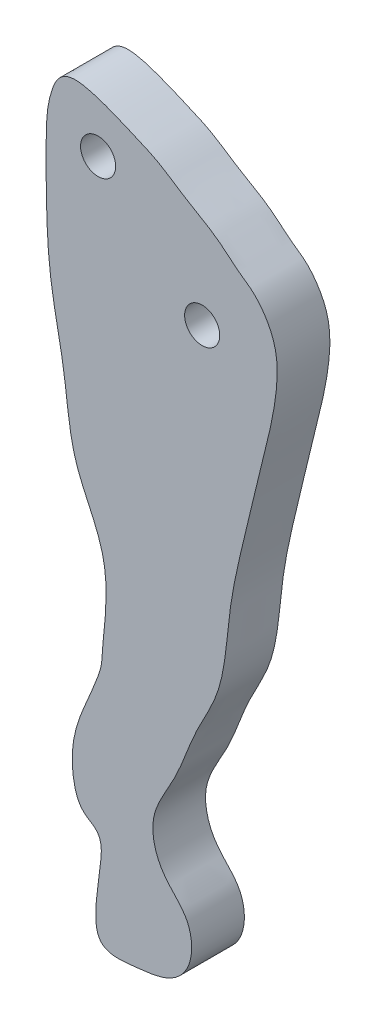
ISO-10303-21;
HEADER;
FILE_DESCRIPTION(('STEP AP214'),'2;1');
FILE_NAME('part.step','',(''),(''),'','','');
FILE_SCHEMA(('AUTOMOTIVE_DESIGN { 1 0 10303 214 1 1 1 1 }'));
ENDSEC;
DATA;
#1=APPLICATION_CONTEXT('core data for automotive mechanical design processes');
#2=APPLICATION_PROTOCOL_DEFINITION('international standard','automotive_design',2000,#1);
#3=PRODUCT_CONTEXT('',#1,'mechanical');
#4=PRODUCT('Part','Part','',(#3));
#5=PRODUCT_RELATED_PRODUCT_CATEGORY('part','',(#4));
#6=PRODUCT_DEFINITION_FORMATION('','',#4);
#7=PRODUCT_DEFINITION_CONTEXT('part definition',#1,'design');
#8=PRODUCT_DEFINITION('design','',#6,#7);
#9=PRODUCT_DEFINITION_SHAPE('','',#8);
#10=(LENGTH_UNIT() NAMED_UNIT(*) SI_UNIT(.MILLI.,.METRE.));
#11=(NAMED_UNIT(*) PLANE_ANGLE_UNIT() SI_UNIT($,.RADIAN.));
#12=(NAMED_UNIT(*) SI_UNIT($,.STERADIAN.) SOLID_ANGLE_UNIT());
#13=UNCERTAINTY_MEASURE_WITH_UNIT(LENGTH_MEASURE(1.E-05),#10,'distance_accuracy_value','');
#14=(GEOMETRIC_REPRESENTATION_CONTEXT(3) GLOBAL_UNCERTAINTY_ASSIGNED_CONTEXT((#13)) GLOBAL_UNIT_ASSIGNED_CONTEXT((#10,
#11,#12)) REPRESENTATION_CONTEXT('',''));
#15=CARTESIAN_POINT('',(0.,0.,0.));
#16=DIRECTION('',(0.,0.,1.));
#17=DIRECTION('',(1.,0.,0.));
#18=AXIS2_PLACEMENT_3D('',#15,#16,#17);
#19=CARTESIAN_POINT('',(-7.75068640306047,-27.7299169254581,3.));
#20=DIRECTION('',(0.,0.,1.));
#21=DIRECTION('',(1.,0.,0.));
#22=AXIS2_PLACEMENT_3D('',#19,#20,#21);
#23=PLANE('',#22);
#24=CARTESIAN_POINT('',(-12.874737023213,9.66234321452957,3.));
#25=DIRECTION('',(0.,0.,1.));
#26=DIRECTION('',(1.,0.,0.));
#27=AXIS2_PLACEMENT_3D('',#24,#25,#26);
#28=CIRCLE('',#27,1.);
#29=CARTESIAN_POINT('',(-11.874737023213,9.66234321452957,3.));
#30=VERTEX_POINT('',#29);
#31=EDGE_CURVE('E46',#30,#30,#28,.T.);
#32=ORIENTED_EDGE('',*,*,#31,.F.);
#33=EDGE_LOOP('',(#32));
#34=FACE_BOUND('',#33,.T.);
#35=CARTESIAN_POINT('',(-15.4682044561492,11.7127470551141,3.));
#36=CARTESIAN_POINT('',(-15.7544673100658,10.9171451790748,3.));
#37=CARTESIAN_POINT('',(-15.8441456091741,9.52640485430083,3.));
#38=CARTESIAN_POINT('',(-15.8377536950557,5.99024798509293,3.));
#39=CARTESIAN_POINT('',(-15.7086350765638,2.21922776594689,3.));
#40=CARTESIAN_POINT('',(-14.6830809593332,-1.98597907958292,3.));
#41=CARTESIAN_POINT('',(-14.4535239210102,-6.34819043758016,3.));
#42=CARTESIAN_POINT('',(-12.0344761797973,-9.80140381526344,3.));
#43=CARTESIAN_POINT('',(-12.8445754757671,-15.7320977367462,3.));
#44=CARTESIAN_POINT('',(-12.4673436919587,-15.1428809154969,3.));
#45=CARTESIAN_POINT('',(-14.5672957333291,-19.967840925612,3.));
#46=CARTESIAN_POINT('',(-14.1266697429101,-22.990564433252,3.));
#47=CARTESIAN_POINT('',(-12.4487210163301,-23.6774489776159,3.));
#48=CARTESIAN_POINT('',(-12.7469655455262,-24.9861346245134,3.));
#49=CARTESIAN_POINT('',(-13.2740593441268,-29.5417563099526,3.));
#50=CARTESIAN_POINT('',(-11.0194235705127,-29.275771778189,3.));
#51=CARTESIAN_POINT('',(-8.6938773371134,-29.0443670100423,3.));
#52=CARTESIAN_POINT('',(-7.42130025178239,-27.7007159992083,3.));
#53=CARTESIAN_POINT('',(-7.56803412746985,-25.2776182334678,3.));
#54=CARTESIAN_POINT('',(-9.40773930226199,-23.9484320171084,3.));
#55=CARTESIAN_POINT('',(-10.0991753781121,-21.2773045525642,3.));
#56=CARTESIAN_POINT('',(-8.34889322816995,-18.8594392819673,3.));
#57=CARTESIAN_POINT('',(-7.50780860088234,-16.0940305767003,3.));
#58=CARTESIAN_POINT('',(-5.63135078781031,-13.0445297644753,3.));
#59=CARTESIAN_POINT('',(-5.52782898057051,-8.84776405611098,3.));
#60=CARTESIAN_POINT('',(-4.47074765830761,-4.72991582790627,3.));
#61=CARTESIAN_POINT('',(-3.69943878110338,-1.34684714443823,3.));
#62=CARTESIAN_POINT('',(-3.10205964326893,0.907695055283288,3.));
#63=CARTESIAN_POINT('',(-2.62986421475999,3.30204689048553,3.));
#64=CARTESIAN_POINT('',(-2.65088275301096,5.6577304133364,3.));
#65=CARTESIAN_POINT('',(-3.81964933684487,7.26492470645652,3.));
#66=CARTESIAN_POINT('',(-4.4681191262396,7.6881431822958,3.));
#67=CARTESIAN_POINT('',(-5.22414609410086,8.24055464810256,3.));
#68=CARTESIAN_POINT('',(-6.08616979972861,9.07665167758778,3.));
#69=CARTESIAN_POINT('',(-7.93560640497182,10.0666801998551,3.));
#70=CARTESIAN_POINT('',(-9.37885999057812,11.1011055768679,3.));
#71=CARTESIAN_POINT('',(-10.7472108757102,11.6856200716329,3.));
#72=CARTESIAN_POINT('',(-14.6942617711478,13.3754564952877,3.));
#73=CARTESIAN_POINT('',(-15.2724463231781,12.2568118393181,3.));
#74=CARTESIAN_POINT('',(-15.4682044561492,11.7127470551141,3.));
#75=B_SPLINE_CURVE_WITH_KNOTS('',3,(#35,#36,#37,#38,#39,#40,#41,#42,#43,#44,#45,#46,#47,#48,#49,
#50,#51,#52,#53,#54,#55,#56,#57,#58,#59,#60,#61,#62,#63,#64,#65,#66,#67,#68,#69,#70,#71,#72,#73,
#74),.UNSPECIFIED.,.T.,.F.,(4,1,1,1,1,1,1,1,1,1,1,1,1,1,1,1,1,1,1,1,1,1,1,1,1,1,1,1,1,1,1,1,1,1,
1,1,1,4),(0.,0.0280294497832513,0.0573151668265758,0.107085229722712,0.15053059861478,
0.195480441114869,0.242856263773221,0.284868296441459,0.346028631029938,0.365258833711303,
0.377334448121911,0.390295357574165,0.42466315868929,0.443525871396655,0.464371613909533,
0.479434702604769,0.503023913874125,0.523701089664602,0.547079179766223,0.572270659609402,
0.602358089488805,0.637256406214172,0.665265584942903,0.714860943360043,0.767135942011383,
0.803257978311219,0.822217077505681,0.849264836467304,0.874571821179535,0.898521318281409,
0.903179517514216,0.905265809712138,0.919384240260622,0.934637401372006,0.950778869954402,
0.964147985663621,0.980832327063381,1.),.UNSPECIFIED.);
#76=CARTESIAN_POINT('',(-15.4682044561492,11.7127470551141,3.));
#77=VERTEX_POINT('',#76);
#78=EDGE_CURVE('E10',#77,#77,#75,.T.);
#79=ORIENTED_EDGE('',*,*,#78,.T.);
#80=EDGE_LOOP('',(#79));
#81=FACE_BOUND('',#80,.T.);
#82=CARTESIAN_POINT('',(-6.94707134946173,4.28993410313171,3.));
#83=DIRECTION('',(0.,0.,1.));
#84=DIRECTION('',(1.,0.,0.));
#85=AXIS2_PLACEMENT_3D('',#82,#83,#84);
#86=CIRCLE('',#85,1.);
#87=CARTESIAN_POINT('',(-5.94707134946173,4.28993410313171,3.));
#88=VERTEX_POINT('',#87);
#89=EDGE_CURVE('E57',#88,#88,#86,.T.);
#90=ORIENTED_EDGE('',*,*,#89,.F.);
#91=EDGE_LOOP('',(#90));
#92=FACE_BOUND('',#91,.T.);
#93=ADVANCED_FACE('F33',(#34,#81,#92),#23,.T.);
#94=CARTESIAN_POINT('',(-7.75068640306047,-27.7299169254581,0.));
#95=DIRECTION('',(0.,0.,1.));
#96=DIRECTION('',(1.,0.,0.));
#97=AXIS2_PLACEMENT_3D('',#94,#95,#96);
#98=PLANE('',#97);
#99=CARTESIAN_POINT('',(-15.4682044561492,11.7127470551141,0.));
#100=CARTESIAN_POINT('',(-15.7544673100658,10.9171451790748,0.));
#101=CARTESIAN_POINT('',(-15.8441456091741,9.52640485430083,0.));
#102=CARTESIAN_POINT('',(-15.8377536950557,5.99024798509293,0.));
#103=CARTESIAN_POINT('',(-15.7086350765638,2.21922776594689,0.));
#104=CARTESIAN_POINT('',(-14.6830809593332,-1.98597907958292,0.));
#105=CARTESIAN_POINT('',(-14.4535239210102,-6.34819043758016,0.));
#106=CARTESIAN_POINT('',(-12.0344761797973,-9.80140381526344,0.));
#107=CARTESIAN_POINT('',(-12.8445754757671,-15.7320977367462,0.));
#108=CARTESIAN_POINT('',(-12.4673436919587,-15.1428809154969,0.));
#109=CARTESIAN_POINT('',(-14.5672957333291,-19.967840925612,0.));
#110=CARTESIAN_POINT('',(-14.1266697429101,-22.990564433252,0.));
#111=CARTESIAN_POINT('',(-12.4487210163301,-23.6774489776159,0.));
#112=CARTESIAN_POINT('',(-12.7469655455262,-24.9861346245134,0.));
#113=CARTESIAN_POINT('',(-13.2740593441268,-29.5417563099526,0.));
#114=CARTESIAN_POINT('',(-11.0194235705127,-29.275771778189,0.));
#115=CARTESIAN_POINT('',(-8.6938773371134,-29.0443670100423,0.));
#116=CARTESIAN_POINT('',(-7.42130025178239,-27.7007159992083,0.));
#117=CARTESIAN_POINT('',(-7.56803412746985,-25.2776182334678,0.));
#118=CARTESIAN_POINT('',(-9.40773930226199,-23.9484320171084,0.));
#119=CARTESIAN_POINT('',(-10.0991753781121,-21.2773045525642,0.));
#120=CARTESIAN_POINT('',(-8.34889322816995,-18.8594392819673,0.));
#121=CARTESIAN_POINT('',(-7.50780860088234,-16.0940305767003,0.));
#122=CARTESIAN_POINT('',(-5.63135078781031,-13.0445297644753,0.));
#123=CARTESIAN_POINT('',(-5.52782898057051,-8.84776405611098,0.));
#124=CARTESIAN_POINT('',(-4.47074765830761,-4.72991582790627,0.));
#125=CARTESIAN_POINT('',(-3.69943878110338,-1.34684714443823,0.));
#126=CARTESIAN_POINT('',(-3.10205964326893,0.907695055283288,0.));
#127=CARTESIAN_POINT('',(-2.62986421475999,3.30204689048553,0.));
#128=CARTESIAN_POINT('',(-2.65088275301096,5.6577304133364,0.));
#129=CARTESIAN_POINT('',(-3.81964933684487,7.26492470645652,0.));
#130=CARTESIAN_POINT('',(-4.4681191262396,7.6881431822958,0.));
#131=CARTESIAN_POINT('',(-5.22414609410086,8.24055464810256,0.));
#132=CARTESIAN_POINT('',(-6.08616979972861,9.07665167758778,0.));
#133=CARTESIAN_POINT('',(-7.93560640497182,10.0666801998551,0.));
#134=CARTESIAN_POINT('',(-9.37885999057812,11.1011055768679,0.));
#135=CARTESIAN_POINT('',(-10.7472108757102,11.6856200716329,0.));
#136=CARTESIAN_POINT('',(-14.6942617711478,13.3754564952877,0.));
#137=CARTESIAN_POINT('',(-15.2724463231781,12.2568118393181,0.));
#138=CARTESIAN_POINT('',(-15.4682044561492,11.7127470551141,0.));
#139=B_SPLINE_CURVE_WITH_KNOTS('',3,(#99,#100,#101,#102,#103,#104,#105,#106,#107,#108,#109,#110,
#111,#112,#113,#114,#115,#116,#117,#118,#119,#120,#121,#122,#123,#124,#125,#126,#127,#128,#129,
#130,#131,#132,#133,#134,#135,#136,#137,#138),.UNSPECIFIED.,.T.,.F.,(4,1,1,1,1,1,1,1,1,1,1,1,1,
1,1,1,1,1,1,1,1,1,1,1,1,1,1,1,1,1,1,1,1,1,1,1,1,4),(0.,0.0280294497832513,0.0573151668265758,
0.107085229722712,0.15053059861478,0.195480441114869,0.242856263773221,0.284868296441459,
0.346028631029938,0.365258833711303,0.377334448121911,0.390295357574165,0.42466315868929,
0.443525871396655,0.464371613909533,0.479434702604769,0.503023913874125,0.523701089664602,
0.547079179766223,0.572270659609402,0.602358089488805,0.637256406214172,0.665265584942903,
0.714860943360043,0.767135942011383,0.803257978311219,0.822217077505681,0.849264836467304,
0.874571821179535,0.898521318281409,0.903179517514216,0.905265809712138,0.919384240260622,
0.934637401372006,0.950778869954402,0.964147985663621,0.980832327063381,1.),.UNSPECIFIED.);
#140=CARTESIAN_POINT('',(-15.4682044561492,11.7127470551141,0.));
#141=VERTEX_POINT('',#140);
#142=EDGE_CURVE('E38',#141,#141,#139,.T.);
#143=ORIENTED_EDGE('',*,*,#142,.F.);
#144=EDGE_LOOP('',(#143));
#145=FACE_BOUND('',#144,.T.);
#146=CARTESIAN_POINT('',(-12.874737023213,9.66234321452957,0.));
#147=DIRECTION('',(0.,0.,1.));
#148=DIRECTION('',(1.,0.,0.));
#149=AXIS2_PLACEMENT_3D('',#146,#147,#148);
#150=CIRCLE('',#149,1.);
#151=CARTESIAN_POINT('',(-11.874737023213,9.66234321452957,0.));
#152=VERTEX_POINT('',#151);
#153=EDGE_CURVE('E51',#152,#152,#150,.T.);
#154=ORIENTED_EDGE('',*,*,#153,.T.);
#155=EDGE_LOOP('',(#154));
#156=FACE_BOUND('',#155,.T.);
#157=CARTESIAN_POINT('',(-6.94707134946173,4.28993410313171,0.));
#158=DIRECTION('',(0.,0.,1.));
#159=DIRECTION('',(1.,0.,0.));
#160=AXIS2_PLACEMENT_3D('',#157,#158,#159);
#161=CIRCLE('',#160,1.);
#162=CARTESIAN_POINT('',(-5.94707134946173,4.28993410313171,0.));
#163=VERTEX_POINT('',#162);
#164=EDGE_CURVE('E60',#163,#163,#161,.T.);
#165=ORIENTED_EDGE('',*,*,#164,.T.);
#166=EDGE_LOOP('',(#165));
#167=FACE_BOUND('',#166,.T.);
#168=ADVANCED_FACE('F70',(#145,#156,#167),#98,.F.);
#169=DIRECTION('',(0.,0.,-1.));
#170=VECTOR('',#169,1.);
#171=SURFACE_OF_LINEAR_EXTRUSION('',#75,#170);
#172=ORIENTED_EDGE('',*,*,#78,.F.);
#173=EDGE_LOOP('',(#172));
#174=FACE_BOUND('',#173,.T.);
#175=ORIENTED_EDGE('',*,*,#142,.T.);
#176=EDGE_LOOP('',(#175));
#177=FACE_BOUND('',#176,.T.);
#178=ADVANCED_FACE('F35',(#174,#177),#171,.F.);
#179=CARTESIAN_POINT('',(-12.874737023213,9.66234321452957,3.));
#180=DIRECTION('',(0.,0.,-1.));
#181=DIRECTION('',(-1.,0.,0.));
#182=AXIS2_PLACEMENT_3D('',#179,#180,#181);
#183=CYLINDRICAL_SURFACE('',#182,1.);
#184=ORIENTED_EDGE('',*,*,#31,.T.);
#185=EDGE_LOOP('',(#184));
#186=FACE_BOUND('',#185,.T.);
#187=ORIENTED_EDGE('',*,*,#153,.F.);
#188=EDGE_LOOP('',(#187));
#189=FACE_BOUND('',#188,.T.);
#190=ADVANCED_FACE('F79',(#186,#189),#183,.F.);
#191=CARTESIAN_POINT('',(-6.94707134946173,4.28993410313171,3.));
#192=DIRECTION('',(0.,0.,-1.));
#193=DIRECTION('',(-1.,0.,0.));
#194=AXIS2_PLACEMENT_3D('',#191,#192,#193);
#195=CYLINDRICAL_SURFACE('',#194,1.);
#196=ORIENTED_EDGE('',*,*,#89,.T.);
#197=EDGE_LOOP('',(#196));
#198=FACE_BOUND('',#197,.T.);
#199=ORIENTED_EDGE('',*,*,#164,.F.);
#200=EDGE_LOOP('',(#199));
#201=FACE_BOUND('',#200,.T.);
#202=ADVANCED_FACE('F66',(#198,#201),#195,.F.);
#203=CLOSED_SHELL('',(#93,#168,#178,#190,#202));
#204=MANIFOLD_SOLID_BREP('B2',#203);
#205=ADVANCED_BREP_SHAPE_REPRESENTATION('',(#18,#204),#14);
#206=SHAPE_DEFINITION_REPRESENTATION(#9,#205);
ENDSEC;
END-ISO-10303-21;
